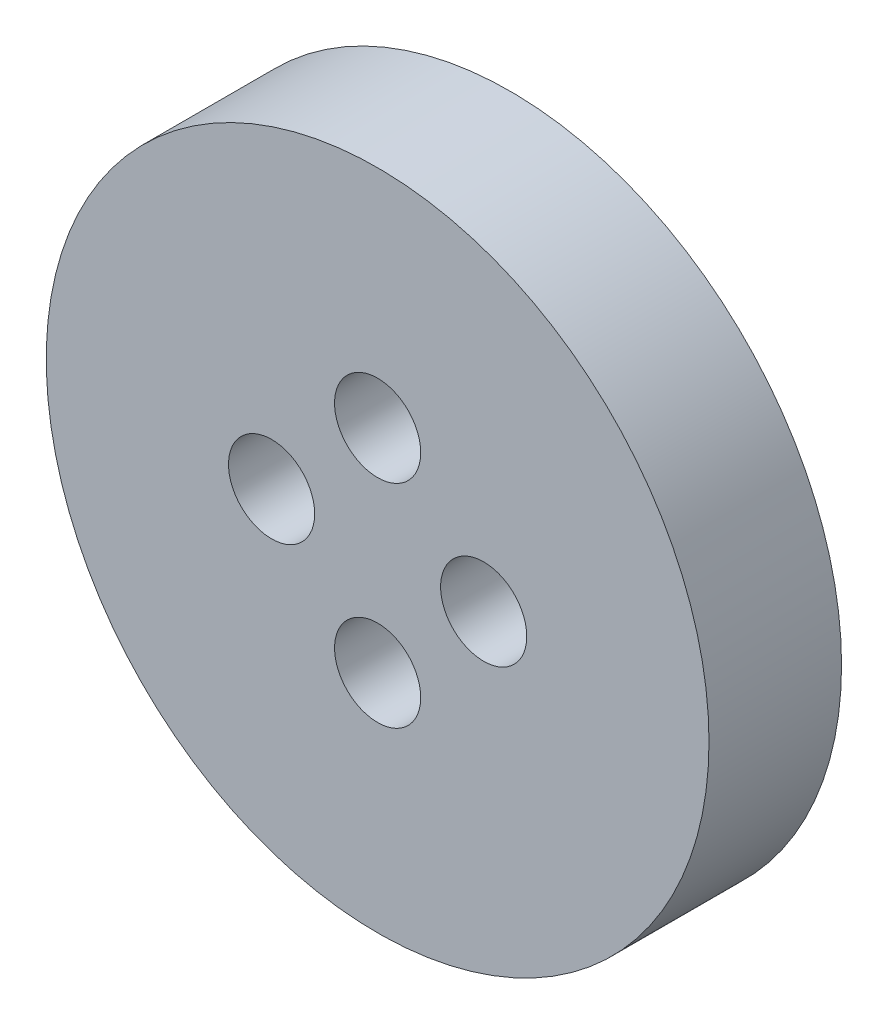
ISO-10303-21;
HEADER;
FILE_DESCRIPTION(('STEP AP214'),'2;1');
FILE_NAME('part.step','',(''),(''),'','','');
FILE_SCHEMA(('AUTOMOTIVE_DESIGN { 1 0 10303 214 1 1 1 1 }'));
ENDSEC;
DATA;
#1=APPLICATION_CONTEXT('core data for automotive mechanical design processes');
#2=APPLICATION_PROTOCOL_DEFINITION('international standard','automotive_design',2000,#1);
#3=PRODUCT_CONTEXT('',#1,'mechanical');
#4=PRODUCT('Part','Part','',(#3));
#5=PRODUCT_RELATED_PRODUCT_CATEGORY('part','',(#4));
#6=PRODUCT_DEFINITION_FORMATION('','',#4);
#7=PRODUCT_DEFINITION_CONTEXT('part definition',#1,'design');
#8=PRODUCT_DEFINITION('design','',#6,#7);
#9=PRODUCT_DEFINITION_SHAPE('','',#8);
#10=(LENGTH_UNIT() NAMED_UNIT(*) SI_UNIT(.MILLI.,.METRE.));
#11=(NAMED_UNIT(*) PLANE_ANGLE_UNIT() SI_UNIT($,.RADIAN.));
#12=(NAMED_UNIT(*) SI_UNIT($,.STERADIAN.) SOLID_ANGLE_UNIT());
#13=UNCERTAINTY_MEASURE_WITH_UNIT(LENGTH_MEASURE(1.E-05),#10,'distance_accuracy_value','');
#14=(GEOMETRIC_REPRESENTATION_CONTEXT(3) GLOBAL_UNCERTAINTY_ASSIGNED_CONTEXT((#13)) GLOBAL_UNIT_ASSIGNED_CONTEXT((#10,
#11,#12)) REPRESENTATION_CONTEXT('',''));
#15=CARTESIAN_POINT('',(0.,0.,0.));
#16=DIRECTION('',(0.,0.,1.));
#17=DIRECTION('',(1.,0.,0.));
#18=AXIS2_PLACEMENT_3D('',#15,#16,#17);
#19=CARTESIAN_POINT('',(8.,0.,10.));
#20=DIRECTION('',(0.,0.,-1.));
#21=DIRECTION('',(-1.,0.,0.));
#22=AXIS2_PLACEMENT_3D('',#19,#20,#21);
#23=CYLINDRICAL_SURFACE('',#22,1.75);
#24=CARTESIAN_POINT('',(8.,0.,0.));
#25=DIRECTION('',(0.,0.,1.));
#26=DIRECTION('',(1.,0.,0.));
#27=AXIS2_PLACEMENT_3D('',#24,#25,#26);
#28=CIRCLE('',#27,1.75);
#29=CARTESIAN_POINT('',(9.75,0.,0.));
#30=VERTEX_POINT('',#29);
#31=EDGE_CURVE('E52',#30,#30,#28,.T.);
#32=ORIENTED_EDGE('',*,*,#31,.F.);
#33=EDGE_LOOP('',(#32));
#34=FACE_BOUND('',#33,.T.);
#35=CARTESIAN_POINT('',(8.,0.,5.));
#36=DIRECTION('',(0.,0.,1.));
#37=DIRECTION('',(1.,0.,0.));
#38=AXIS2_PLACEMENT_3D('',#35,#36,#37);
#39=CIRCLE('',#38,1.75);
#40=CARTESIAN_POINT('',(9.75,0.,5.));
#41=VERTEX_POINT('',#40);
#42=EDGE_CURVE('E41',#41,#41,#39,.T.);
#43=ORIENTED_EDGE('',*,*,#42,.T.);
#44=EDGE_LOOP('',(#43));
#45=FACE_BOUND('',#44,.T.);
#46=ADVANCED_FACE('F37',(#34,#45),#23,.F.);
#47=CARTESIAN_POINT('',(0.,-8.,10.));
#48=DIRECTION('',(0.,0.,-1.));
#49=DIRECTION('',(-1.,0.,0.));
#50=AXIS2_PLACEMENT_3D('',#47,#48,#49);
#51=CYLINDRICAL_SURFACE('',#50,1.75);
#52=CARTESIAN_POINT('',(0.,-8.,0.));
#53=DIRECTION('',(0.,0.,1.));
#54=DIRECTION('',(1.,0.,0.));
#55=AXIS2_PLACEMENT_3D('',#52,#53,#54);
#56=CIRCLE('',#55,1.75);
#57=CARTESIAN_POINT('',(1.75,-8.,0.));
#58=VERTEX_POINT('',#57);
#59=EDGE_CURVE('E83',#58,#58,#56,.T.);
#60=ORIENTED_EDGE('',*,*,#59,.F.);
#61=EDGE_LOOP('',(#60));
#62=FACE_BOUND('',#61,.T.);
#63=CARTESIAN_POINT('',(0.,-8.,5.));
#64=DIRECTION('',(0.,0.,1.));
#65=DIRECTION('',(1.,0.,0.));
#66=AXIS2_PLACEMENT_3D('',#63,#64,#65);
#67=CIRCLE('',#66,1.75);
#68=CARTESIAN_POINT('',(1.75,-8.,5.));
#69=VERTEX_POINT('',#68);
#70=EDGE_CURVE('E65',#69,#69,#67,.T.);
#71=ORIENTED_EDGE('',*,*,#70,.T.);
#72=EDGE_LOOP('',(#71));
#73=FACE_BOUND('',#72,.T.);
#74=ADVANCED_FACE('F99',(#62,#73),#51,.F.);
#75=CARTESIAN_POINT('',(-8.,0.,10.));
#76=DIRECTION('',(0.,0.,-1.));
#77=DIRECTION('',(-1.,0.,0.));
#78=AXIS2_PLACEMENT_3D('',#75,#76,#77);
#79=CYLINDRICAL_SURFACE('',#78,1.75);
#80=CARTESIAN_POINT('',(-8.,0.,0.));
#81=DIRECTION('',(0.,0.,1.));
#82=DIRECTION('',(1.,0.,0.));
#83=AXIS2_PLACEMENT_3D('',#80,#81,#82);
#84=CIRCLE('',#83,1.75);
#85=CARTESIAN_POINT('',(-6.25,0.,0.));
#86=VERTEX_POINT('',#85);
#87=EDGE_CURVE('E77',#86,#86,#84,.T.);
#88=ORIENTED_EDGE('',*,*,#87,.F.);
#89=EDGE_LOOP('',(#88));
#90=FACE_BOUND('',#89,.T.);
#91=CARTESIAN_POINT('',(-8.,0.,5.));
#92=DIRECTION('',(0.,0.,1.));
#93=DIRECTION('',(1.,0.,0.));
#94=AXIS2_PLACEMENT_3D('',#91,#92,#93);
#95=CIRCLE('',#94,1.75);
#96=CARTESIAN_POINT('',(-6.25,0.,5.));
#97=VERTEX_POINT('',#96);
#98=EDGE_CURVE('E61',#97,#97,#95,.T.);
#99=ORIENTED_EDGE('',*,*,#98,.T.);
#100=EDGE_LOOP('',(#99));
#101=FACE_BOUND('',#100,.T.);
#102=ADVANCED_FACE('F104',(#90,#101),#79,.F.);
#103=CARTESIAN_POINT('',(0.,8.,10.));
#104=DIRECTION('',(0.,0.,-1.));
#105=DIRECTION('',(-1.,0.,0.));
#106=AXIS2_PLACEMENT_3D('',#103,#104,#105);
#107=CYLINDRICAL_SURFACE('',#106,1.75);
#108=CARTESIAN_POINT('',(0.,8.,0.));
#109=DIRECTION('',(0.,0.,1.));
#110=DIRECTION('',(1.,0.,0.));
#111=AXIS2_PLACEMENT_3D('',#108,#109,#110);
#112=CIRCLE('',#111,1.75);
#113=CARTESIAN_POINT('',(1.75,8.,0.));
#114=VERTEX_POINT('',#113);
#115=EDGE_CURVE('E72',#114,#114,#112,.T.);
#116=ORIENTED_EDGE('',*,*,#115,.F.);
#117=EDGE_LOOP('',(#116));
#118=FACE_BOUND('',#117,.T.);
#119=CARTESIAN_POINT('',(0.,8.,5.));
#120=DIRECTION('',(0.,0.,1.));
#121=DIRECTION('',(1.,0.,0.));
#122=AXIS2_PLACEMENT_3D('',#119,#120,#121);
#123=CIRCLE('',#122,1.75);
#124=CARTESIAN_POINT('',(1.75,8.,5.));
#125=VERTEX_POINT('',#124);
#126=EDGE_CURVE('E57',#125,#125,#123,.T.);
#127=ORIENTED_EDGE('',*,*,#126,.T.);
#128=EDGE_LOOP('',(#127));
#129=FACE_BOUND('',#128,.T.);
#130=ADVANCED_FACE('F111',(#118,#129),#107,.F.);
#131=CARTESIAN_POINT('',(0.,0.,10.));
#132=DIRECTION('',(0.,0.,1.));
#133=DIRECTION('',(1.,0.,0.));
#134=AXIS2_PLACEMENT_3D('',#131,#132,#133);
#135=PLANE('',#134);
#136=CARTESIAN_POINT('',(0.,8.,10.));
#137=DIRECTION('',(0.,0.,1.));
#138=DIRECTION('',(1.,0.,0.));
#139=AXIS2_PLACEMENT_3D('',#136,#137,#138);
#140=CIRCLE('',#139,3.25);
#141=CARTESIAN_POINT('',(3.25,8.,10.));
#142=VERTEX_POINT('',#141);
#143=EDGE_CURVE('E180',#142,#142,#140,.T.);
#144=ORIENTED_EDGE('',*,*,#143,.F.);
#145=EDGE_LOOP('',(#144));
#146=FACE_BOUND('',#145,.T.);
#147=CARTESIAN_POINT('',(-8.,0.,10.));
#148=DIRECTION('',(0.,0.,1.));
#149=DIRECTION('',(1.,0.,0.));
#150=AXIS2_PLACEMENT_3D('',#147,#148,#149);
#151=CIRCLE('',#150,3.25);
#152=CARTESIAN_POINT('',(-4.75,0.,10.));
#153=VERTEX_POINT('',#152);
#154=EDGE_CURVE('E174',#153,#153,#151,.T.);
#155=ORIENTED_EDGE('',*,*,#154,.F.);
#156=EDGE_LOOP('',(#155));
#157=FACE_BOUND('',#156,.T.);
#158=CARTESIAN_POINT('',(0.,-8.,10.));
#159=DIRECTION('',(0.,0.,1.));
#160=DIRECTION('',(1.,0.,0.));
#161=AXIS2_PLACEMENT_3D('',#158,#159,#160);
#162=CIRCLE('',#161,3.25);
#163=CARTESIAN_POINT('',(3.25,-8.,10.));
#164=VERTEX_POINT('',#163);
#165=EDGE_CURVE('E175',#164,#164,#162,.T.);
#166=ORIENTED_EDGE('',*,*,#165,.F.);
#167=EDGE_LOOP('',(#166));
#168=FACE_BOUND('',#167,.T.);
#169=CARTESIAN_POINT('',(8.,0.,10.));
#170=DIRECTION('',(0.,0.,1.));
#171=DIRECTION('',(1.,0.,0.));
#172=AXIS2_PLACEMENT_3D('',#169,#170,#171);
#173=CIRCLE('',#172,3.25);
#174=CARTESIAN_POINT('',(11.25,0.,10.));
#175=VERTEX_POINT('',#174);
#176=EDGE_CURVE('E189',#175,#175,#173,.T.);
#177=ORIENTED_EDGE('',*,*,#176,.F.);
#178=EDGE_LOOP('',(#177));
#179=FACE_BOUND('',#178,.T.);
#180=CARTESIAN_POINT('',(0.,0.,10.));
#181=DIRECTION('',(0.,0.,1.));
#182=DIRECTION('',(1.,0.,0.));
#183=AXIS2_PLACEMENT_3D('',#180,#181,#182);
#184=CIRCLE('',#183,25.);
#185=CARTESIAN_POINT('',(25.,0.,10.));
#186=VERTEX_POINT('',#185);
#187=EDGE_CURVE('E10',#186,#186,#184,.T.);
#188=ORIENTED_EDGE('',*,*,#187,.T.);
#189=EDGE_LOOP('',(#188));
#190=FACE_BOUND('',#189,.T.);
#191=ADVANCED_FACE('F109',(#146,#157,#168,#179,#190),#135,.T.);
#192=CARTESIAN_POINT('',(0.,0.,0.));
#193=DIRECTION('',(0.,0.,1.));
#194=DIRECTION('',(1.,0.,0.));
#195=AXIS2_PLACEMENT_3D('',#192,#193,#194);
#196=PLANE('',#195);
#197=CARTESIAN_POINT('',(0.,0.,0.));
#198=DIRECTION('',(0.,0.,1.));
#199=DIRECTION('',(1.,0.,0.));
#200=AXIS2_PLACEMENT_3D('',#197,#198,#199);
#201=CIRCLE('',#200,25.);
#202=CARTESIAN_POINT('',(25.,0.,0.));
#203=VERTEX_POINT('',#202);
#204=EDGE_CURVE('E46',#203,#203,#201,.T.);
#205=ORIENTED_EDGE('',*,*,#204,.F.);
#206=EDGE_LOOP('',(#205));
#207=FACE_BOUND('',#206,.T.);
#208=ORIENTED_EDGE('',*,*,#31,.T.);
#209=EDGE_LOOP('',(#208));
#210=FACE_BOUND('',#209,.T.);
#211=ORIENTED_EDGE('',*,*,#59,.T.);
#212=EDGE_LOOP('',(#211));
#213=FACE_BOUND('',#212,.T.);
#214=ORIENTED_EDGE('',*,*,#87,.T.);
#215=EDGE_LOOP('',(#214));
#216=FACE_BOUND('',#215,.T.);
#217=ORIENTED_EDGE('',*,*,#115,.T.);
#218=EDGE_LOOP('',(#217));
#219=FACE_BOUND('',#218,.T.);
#220=ADVANCED_FACE('F96',(#207,#210,#213,#216,#219),#196,.F.);
#221=CARTESIAN_POINT('',(0.,0.,10.));
#222=DIRECTION('',(0.,0.,-1.));
#223=DIRECTION('',(-1.,0.,0.));
#224=AXIS2_PLACEMENT_3D('',#221,#222,#223);
#225=CYLINDRICAL_SURFACE('',#224,25.);
#226=ORIENTED_EDGE('',*,*,#187,.F.);
#227=EDGE_LOOP('',(#226));
#228=FACE_BOUND('',#227,.T.);
#229=ORIENTED_EDGE('',*,*,#204,.T.);
#230=EDGE_LOOP('',(#229));
#231=FACE_BOUND('',#230,.T.);
#232=ADVANCED_FACE('F39',(#228,#231),#225,.T.);
#233=CARTESIAN_POINT('',(0.,8.,5.));
#234=DIRECTION('',(0.,0.,1.));
#235=DIRECTION('',(1.,0.,0.));
#236=AXIS2_PLACEMENT_3D('',#233,#234,#235);
#237=CYLINDRICAL_SURFACE('',#236,3.25);
#238=CARTESIAN_POINT('',(0.,8.,5.));
#239=DIRECTION('',(0.,0.,1.));
#240=DIRECTION('',(1.,0.,0.));
#241=AXIS2_PLACEMENT_3D('',#238,#239,#240);
#242=CIRCLE('',#241,3.25);
#243=CARTESIAN_POINT('',(3.25,8.,5.));
#244=VERTEX_POINT('',#243);
#245=EDGE_CURVE('E62',#244,#244,#242,.T.);
#246=ORIENTED_EDGE('',*,*,#245,.F.);
#247=EDGE_LOOP('',(#246));
#248=FACE_BOUND('',#247,.T.);
#249=ORIENTED_EDGE('',*,*,#143,.T.);
#250=EDGE_LOOP('',(#249));
#251=FACE_BOUND('',#250,.T.);
#252=ADVANCED_FACE('F118',(#248,#251),#237,.F.);
#253=CARTESIAN_POINT('',(0.,8.,5.));
#254=DIRECTION('',(0.,0.,1.));
#255=DIRECTION('',(1.,0.,0.));
#256=AXIS2_PLACEMENT_3D('',#253,#254,#255);
#257=PLANE('',#256);
#258=ORIENTED_EDGE('',*,*,#126,.F.);
#259=EDGE_LOOP('',(#258));
#260=FACE_BOUND('',#259,.T.);
#261=ORIENTED_EDGE('',*,*,#245,.T.);
#262=EDGE_LOOP('',(#261));
#263=FACE_BOUND('',#262,.T.);
#264=ADVANCED_FACE('F125',(#260,#263),#257,.T.);
#265=CARTESIAN_POINT('',(-8.,0.,5.));
#266=DIRECTION('',(0.,0.,1.));
#267=DIRECTION('',(1.,0.,0.));
#268=AXIS2_PLACEMENT_3D('',#265,#266,#267);
#269=CYLINDRICAL_SURFACE('',#268,3.25);
#270=CARTESIAN_POINT('',(-8.,0.,5.));
#271=DIRECTION('',(0.,0.,1.));
#272=DIRECTION('',(1.,0.,0.));
#273=AXIS2_PLACEMENT_3D('',#270,#271,#272);
#274=CIRCLE('',#273,3.25);
#275=CARTESIAN_POINT('',(-4.75,0.,5.));
#276=VERTEX_POINT('',#275);
#277=EDGE_CURVE('E172',#276,#276,#274,.T.);
#278=ORIENTED_EDGE('',*,*,#277,.F.);
#279=EDGE_LOOP('',(#278));
#280=FACE_BOUND('',#279,.T.);
#281=ORIENTED_EDGE('',*,*,#154,.T.);
#282=EDGE_LOOP('',(#281));
#283=FACE_BOUND('',#282,.T.);
#284=ADVANCED_FACE('F131',(#280,#283),#269,.F.);
#285=CARTESIAN_POINT('',(-8.,0.,5.));
#286=DIRECTION('',(0.,0.,1.));
#287=DIRECTION('',(1.,0.,0.));
#288=AXIS2_PLACEMENT_3D('',#285,#286,#287);
#289=PLANE('',#288);
#290=ORIENTED_EDGE('',*,*,#98,.F.);
#291=EDGE_LOOP('',(#290));
#292=FACE_BOUND('',#291,.T.);
#293=ORIENTED_EDGE('',*,*,#277,.T.);
#294=EDGE_LOOP('',(#293));
#295=FACE_BOUND('',#294,.T.);
#296=ADVANCED_FACE('F139',(#292,#295),#289,.T.);
#297=CARTESIAN_POINT('',(0.,-8.,5.));
#298=DIRECTION('',(0.,0.,1.));
#299=DIRECTION('',(1.,0.,0.));
#300=AXIS2_PLACEMENT_3D('',#297,#298,#299);
#301=CYLINDRICAL_SURFACE('',#300,3.25);
#302=CARTESIAN_POINT('',(0.,-8.,5.));
#303=DIRECTION('',(0.,0.,1.));
#304=DIRECTION('',(1.,0.,0.));
#305=AXIS2_PLACEMENT_3D('',#302,#303,#304);
#306=CIRCLE('',#305,3.25);
#307=CARTESIAN_POINT('',(3.25,-8.,5.));
#308=VERTEX_POINT('',#307);
#309=EDGE_CURVE('E183',#308,#308,#306,.T.);
#310=ORIENTED_EDGE('',*,*,#309,.F.);
#311=EDGE_LOOP('',(#310));
#312=FACE_BOUND('',#311,.T.);
#313=ORIENTED_EDGE('',*,*,#165,.T.);
#314=EDGE_LOOP('',(#313));
#315=FACE_BOUND('',#314,.T.);
#316=ADVANCED_FACE('F143',(#312,#315),#301,.F.);
#317=CARTESIAN_POINT('',(0.,-8.,5.));
#318=DIRECTION('',(0.,0.,1.));
#319=DIRECTION('',(1.,0.,0.));
#320=AXIS2_PLACEMENT_3D('',#317,#318,#319);
#321=PLANE('',#320);
#322=ORIENTED_EDGE('',*,*,#70,.F.);
#323=EDGE_LOOP('',(#322));
#324=FACE_BOUND('',#323,.T.);
#325=ORIENTED_EDGE('',*,*,#309,.T.);
#326=EDGE_LOOP('',(#325));
#327=FACE_BOUND('',#326,.T.);
#328=ADVANCED_FACE('F147',(#324,#327),#321,.T.);
#329=CARTESIAN_POINT('',(8.,0.,5.));
#330=DIRECTION('',(0.,0.,1.));
#331=DIRECTION('',(1.,0.,0.));
#332=AXIS2_PLACEMENT_3D('',#329,#330,#331);
#333=CYLINDRICAL_SURFACE('',#332,3.25);
#334=CARTESIAN_POINT('',(8.,0.,5.));
#335=DIRECTION('',(0.,0.,1.));
#336=DIRECTION('',(1.,0.,0.));
#337=AXIS2_PLACEMENT_3D('',#334,#335,#336);
#338=CIRCLE('',#337,3.25);
#339=CARTESIAN_POINT('',(11.25,0.,5.));
#340=VERTEX_POINT('',#339);
#341=EDGE_CURVE('E86',#340,#340,#338,.T.);
#342=ORIENTED_EDGE('',*,*,#341,.F.);
#343=EDGE_LOOP('',(#342));
#344=FACE_BOUND('',#343,.T.);
#345=ORIENTED_EDGE('',*,*,#176,.T.);
#346=EDGE_LOOP('',(#345));
#347=FACE_BOUND('',#346,.T.);
#348=ADVANCED_FACE('F151',(#344,#347),#333,.F.);
#349=CARTESIAN_POINT('',(8.,0.,5.));
#350=DIRECTION('',(0.,0.,1.));
#351=DIRECTION('',(1.,0.,0.));
#352=AXIS2_PLACEMENT_3D('',#349,#350,#351);
#353=PLANE('',#352);
#354=ORIENTED_EDGE('',*,*,#42,.F.);
#355=EDGE_LOOP('',(#354));
#356=FACE_BOUND('',#355,.T.);
#357=ORIENTED_EDGE('',*,*,#341,.T.);
#358=EDGE_LOOP('',(#357));
#359=FACE_BOUND('',#358,.T.);
#360=ADVANCED_FACE('F155',(#356,#359),#353,.T.);
#361=CLOSED_SHELL('',(#46,#74,#102,#130,#191,#220,#232,#252,#264,#284,#296,#316,#328,#348,#360));
#362=MANIFOLD_SOLID_BREP('B2',#361);
#363=ADVANCED_BREP_SHAPE_REPRESENTATION('',(#18,#362),#14);
#364=SHAPE_DEFINITION_REPRESENTATION(#9,#363);
ENDSEC;
END-ISO-10303-21;
